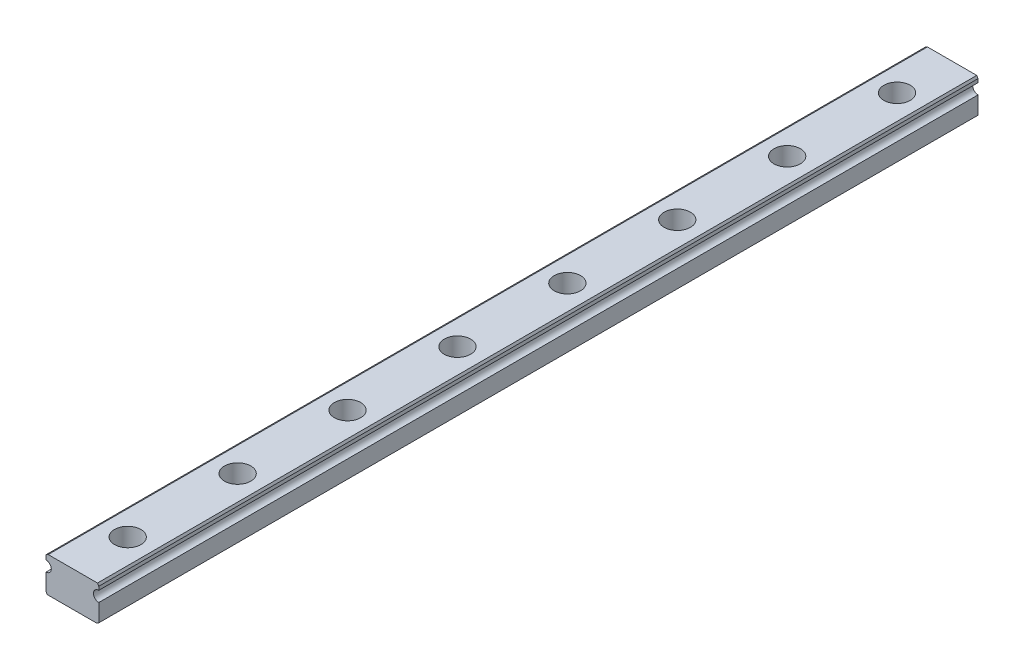
ISO-10303-21;
HEADER;
FILE_DESCRIPTION(('STEP AP214'),'2;1');
FILE_NAME('part.step','',(''),(''),'','','');
FILE_SCHEMA(('AUTOMOTIVE_DESIGN { 1 0 10303 214 1 1 1 1 }'));
ENDSEC;
DATA;
#1=APPLICATION_CONTEXT('core data for automotive mechanical design processes');
#2=APPLICATION_PROTOCOL_DEFINITION('international standard','automotive_design',2000,#1);
#3=PRODUCT_CONTEXT('',#1,'mechanical');
#4=PRODUCT('Part','Part','',(#3));
#5=PRODUCT_RELATED_PRODUCT_CATEGORY('part','',(#4));
#6=PRODUCT_DEFINITION_FORMATION('','',#4);
#7=PRODUCT_DEFINITION_CONTEXT('part definition',#1,'design');
#8=PRODUCT_DEFINITION('design','',#6,#7);
#9=PRODUCT_DEFINITION_SHAPE('','',#8);
#10=(LENGTH_UNIT() NAMED_UNIT(*) SI_UNIT(.MILLI.,.METRE.));
#11=(NAMED_UNIT(*) PLANE_ANGLE_UNIT() SI_UNIT($,.RADIAN.));
#12=(NAMED_UNIT(*) SI_UNIT($,.STERADIAN.) SOLID_ANGLE_UNIT());
#13=UNCERTAINTY_MEASURE_WITH_UNIT(LENGTH_MEASURE(1.E-05),#10,'distance_accuracy_value','');
#14=(GEOMETRIC_REPRESENTATION_CONTEXT(3) GLOBAL_UNCERTAINTY_ASSIGNED_CONTEXT((#13)) GLOBAL_UNIT_ASSIGNED_CONTEXT((#10,
#11,#12)) REPRESENTATION_CONTEXT('',''));
#15=CARTESIAN_POINT('',(0.,0.,0.));
#16=DIRECTION('',(0.,0.,1.));
#17=DIRECTION('',(1.,0.,0.));
#18=AXIS2_PLACEMENT_3D('',#15,#16,#17);
#19=CARTESIAN_POINT('',(0.0924546286147632,-4.001,-87.5));
#20=DIRECTION('',(0.,1.,0.));
#21=DIRECTION('',(0.,0.,1.));
#22=AXIS2_PLACEMENT_3D('',#19,#20,#21);
#23=CYLINDRICAL_SURFACE('',#22,1.75);
#24=CARTESIAN_POINT('',(0.0924546286147632,-4.,-87.5));
#25=DIRECTION('',(0.,1.,0.));
#26=DIRECTION('',(0.,0.,1.));
#27=AXIS2_PLACEMENT_3D('',#24,#25,#26);
#28=CIRCLE('',#27,1.75);
#29=CARTESIAN_POINT('',(0.0924546286147632,-4.,-85.75));
#30=VERTEX_POINT('',#29);
#31=EDGE_CURVE('E257',#30,#30,#28,.F.);
#32=ORIENTED_EDGE('',*,*,#31,.T.);
#33=EDGE_LOOP('',(#32));
#34=FACE_BOUND('',#33,.T.);
#35=CARTESIAN_POINT('',(0.0924546286147632,-0.5,-87.5));
#36=DIRECTION('',(0.,1.,0.));
#37=DIRECTION('',(0.,0.,1.));
#38=AXIS2_PLACEMENT_3D('',#35,#36,#37);
#39=CIRCLE('',#38,1.75);
#40=CARTESIAN_POINT('',(0.0924546286147632,-0.5,-85.75));
#41=VERTEX_POINT('',#40);
#42=EDGE_CURVE('E56',#41,#41,#39,.F.);
#43=ORIENTED_EDGE('',*,*,#42,.F.);
#44=EDGE_LOOP('',(#43));
#45=FACE_BOUND('',#44,.T.);
#46=ADVANCED_FACE('F51',(#34,#45),#23,.F.);
#47=CARTESIAN_POINT('',(0.0924546286147632,-4.001,-62.5));
#48=DIRECTION('',(0.,1.,0.));
#49=DIRECTION('',(0.,0.,1.));
#50=AXIS2_PLACEMENT_3D('',#47,#48,#49);
#51=CYLINDRICAL_SURFACE('',#50,1.75);
#52=CARTESIAN_POINT('',(0.0924546286147632,-4.,-62.5));
#53=DIRECTION('',(0.,1.,0.));
#54=DIRECTION('',(0.,0.,1.));
#55=AXIS2_PLACEMENT_3D('',#52,#53,#54);
#56=CIRCLE('',#55,1.75);
#57=CARTESIAN_POINT('',(0.0924546286147632,-4.,-60.75));
#58=VERTEX_POINT('',#57);
#59=EDGE_CURVE('E261',#58,#58,#56,.F.);
#60=ORIENTED_EDGE('',*,*,#59,.T.);
#61=EDGE_LOOP('',(#60));
#62=FACE_BOUND('',#61,.T.);
#63=CARTESIAN_POINT('',(0.0924546286147632,-0.5,-62.5));
#64=DIRECTION('',(0.,1.,0.));
#65=DIRECTION('',(0.,0.,1.));
#66=AXIS2_PLACEMENT_3D('',#63,#64,#65);
#67=CIRCLE('',#66,1.75);
#68=CARTESIAN_POINT('',(0.0924546286147632,-0.5,-60.75));
#69=VERTEX_POINT('',#68);
#70=EDGE_CURVE('E252',#69,#69,#67,.F.);
#71=ORIENTED_EDGE('',*,*,#70,.F.);
#72=EDGE_LOOP('',(#71));
#73=FACE_BOUND('',#72,.T.);
#74=ADVANCED_FACE('F334',(#62,#73),#51,.F.);
#75=CARTESIAN_POINT('',(0.0924546286147632,-4.001,-37.5));
#76=DIRECTION('',(0.,1.,0.));
#77=DIRECTION('',(0.,0.,1.));
#78=AXIS2_PLACEMENT_3D('',#75,#76,#77);
#79=CYLINDRICAL_SURFACE('',#78,1.75);
#80=CARTESIAN_POINT('',(0.0924546286147632,-4.,-37.5));
#81=DIRECTION('',(0.,1.,0.));
#82=DIRECTION('',(0.,0.,1.));
#83=AXIS2_PLACEMENT_3D('',#80,#81,#82);
#84=CIRCLE('',#83,1.75);
#85=CARTESIAN_POINT('',(0.0924546286147632,-4.,-35.75));
#86=VERTEX_POINT('',#85);
#87=EDGE_CURVE('E266',#86,#86,#84,.F.);
#88=ORIENTED_EDGE('',*,*,#87,.T.);
#89=EDGE_LOOP('',(#88));
#90=FACE_BOUND('',#89,.T.);
#91=CARTESIAN_POINT('',(0.0924546286147632,-0.5,-37.5));
#92=DIRECTION('',(0.,1.,0.));
#93=DIRECTION('',(0.,0.,1.));
#94=AXIS2_PLACEMENT_3D('',#91,#92,#93);
#95=CIRCLE('',#94,1.75);
#96=CARTESIAN_POINT('',(0.0924546286147632,-0.5,-35.75));
#97=VERTEX_POINT('',#96);
#98=EDGE_CURVE('E250',#97,#97,#95,.F.);
#99=ORIENTED_EDGE('',*,*,#98,.F.);
#100=EDGE_LOOP('',(#99));
#101=FACE_BOUND('',#100,.T.);
#102=ADVANCED_FACE('F339',(#90,#101),#79,.F.);
#103=CARTESIAN_POINT('',(0.0924546286147632,-4.001,-12.5));
#104=DIRECTION('',(0.,1.,0.));
#105=DIRECTION('',(0.,0.,1.));
#106=AXIS2_PLACEMENT_3D('',#103,#104,#105);
#107=CYLINDRICAL_SURFACE('',#106,1.75);
#108=CARTESIAN_POINT('',(0.0924546286147632,-4.,-12.5));
#109=DIRECTION('',(0.,1.,0.));
#110=DIRECTION('',(0.,0.,1.));
#111=AXIS2_PLACEMENT_3D('',#108,#109,#110);
#112=CIRCLE('',#111,1.75);
#113=CARTESIAN_POINT('',(0.0924546286147632,-4.,-10.75));
#114=VERTEX_POINT('',#113);
#115=EDGE_CURVE('E734',#114,#114,#112,.F.);
#116=ORIENTED_EDGE('',*,*,#115,.T.);
#117=EDGE_LOOP('',(#116));
#118=FACE_BOUND('',#117,.T.);
#119=CARTESIAN_POINT('',(0.0924546286147632,-0.5,-12.5));
#120=DIRECTION('',(0.,1.,0.));
#121=DIRECTION('',(0.,0.,1.));
#122=AXIS2_PLACEMENT_3D('',#119,#120,#121);
#123=CIRCLE('',#122,1.75);
#124=CARTESIAN_POINT('',(0.0924546286147632,-0.5,-10.75));
#125=VERTEX_POINT('',#124);
#126=EDGE_CURVE('E247',#125,#125,#123,.F.);
#127=ORIENTED_EDGE('',*,*,#126,.F.);
#128=EDGE_LOOP('',(#127));
#129=FACE_BOUND('',#128,.T.);
#130=ADVANCED_FACE('F618',(#118,#129),#107,.F.);
#131=CARTESIAN_POINT('',(0.0924546286147632,-4.001,12.5));
#132=DIRECTION('',(0.,1.,0.));
#133=DIRECTION('',(0.,0.,1.));
#134=AXIS2_PLACEMENT_3D('',#131,#132,#133);
#135=CYLINDRICAL_SURFACE('',#134,1.75);
#136=CARTESIAN_POINT('',(0.0924546286147632,-4.,12.5));
#137=DIRECTION('',(0.,1.,0.));
#138=DIRECTION('',(0.,0.,1.));
#139=AXIS2_PLACEMENT_3D('',#136,#137,#138);
#140=CIRCLE('',#139,1.75);
#141=CARTESIAN_POINT('',(0.0924546286147632,-4.,14.25));
#142=VERTEX_POINT('',#141);
#143=EDGE_CURVE('E726',#142,#142,#140,.F.);
#144=ORIENTED_EDGE('',*,*,#143,.T.);
#145=EDGE_LOOP('',(#144));
#146=FACE_BOUND('',#145,.T.);
#147=CARTESIAN_POINT('',(0.0924546286147632,-0.5,12.5));
#148=DIRECTION('',(0.,1.,0.));
#149=DIRECTION('',(0.,0.,1.));
#150=AXIS2_PLACEMENT_3D('',#147,#148,#149);
#151=CIRCLE('',#150,1.75);
#152=CARTESIAN_POINT('',(0.0924546286147632,-0.5,14.25));
#153=VERTEX_POINT('',#152);
#154=EDGE_CURVE('E244',#153,#153,#151,.F.);
#155=ORIENTED_EDGE('',*,*,#154,.F.);
#156=EDGE_LOOP('',(#155));
#157=FACE_BOUND('',#156,.T.);
#158=ADVANCED_FACE('F627',(#146,#157),#135,.F.);
#159=CARTESIAN_POINT('',(0.0924546286147632,-4.001,37.5));
#160=DIRECTION('',(0.,1.,0.));
#161=DIRECTION('',(0.,0.,1.));
#162=AXIS2_PLACEMENT_3D('',#159,#160,#161);
#163=CYLINDRICAL_SURFACE('',#162,1.75);
#164=CARTESIAN_POINT('',(0.0924546286147632,-4.,37.5));
#165=DIRECTION('',(0.,1.,0.));
#166=DIRECTION('',(0.,0.,1.));
#167=AXIS2_PLACEMENT_3D('',#164,#165,#166);
#168=CIRCLE('',#167,1.75);
#169=CARTESIAN_POINT('',(0.0924546286147632,-4.,39.25));
#170=VERTEX_POINT('',#169);
#171=EDGE_CURVE('E723',#170,#170,#168,.F.);
#172=ORIENTED_EDGE('',*,*,#171,.T.);
#173=EDGE_LOOP('',(#172));
#174=FACE_BOUND('',#173,.T.);
#175=CARTESIAN_POINT('',(0.0924546286147632,-0.5,37.5));
#176=DIRECTION('',(0.,1.,0.));
#177=DIRECTION('',(0.,0.,1.));
#178=AXIS2_PLACEMENT_3D('',#175,#176,#177);
#179=CIRCLE('',#178,1.75);
#180=CARTESIAN_POINT('',(0.0924546286147632,-0.5,39.25));
#181=VERTEX_POINT('',#180);
#182=EDGE_CURVE('E240',#181,#181,#179,.F.);
#183=ORIENTED_EDGE('',*,*,#182,.F.);
#184=EDGE_LOOP('',(#183));
#185=FACE_BOUND('',#184,.T.);
#186=ADVANCED_FACE('F637',(#174,#185),#163,.F.);
#187=CARTESIAN_POINT('',(0.0924546286147632,-4.001,62.5));
#188=DIRECTION('',(0.,1.,0.));
#189=DIRECTION('',(0.,0.,1.));
#190=AXIS2_PLACEMENT_3D('',#187,#188,#189);
#191=CYLINDRICAL_SURFACE('',#190,1.75);
#192=CARTESIAN_POINT('',(0.0924546286147632,-4.,62.5));
#193=DIRECTION('',(0.,1.,0.));
#194=DIRECTION('',(0.,0.,1.));
#195=AXIS2_PLACEMENT_3D('',#192,#193,#194);
#196=CIRCLE('',#195,1.75);
#197=CARTESIAN_POINT('',(0.0924546286147632,-4.,64.25));
#198=VERTEX_POINT('',#197);
#199=EDGE_CURVE('E275',#198,#198,#196,.F.);
#200=ORIENTED_EDGE('',*,*,#199,.T.);
#201=EDGE_LOOP('',(#200));
#202=FACE_BOUND('',#201,.T.);
#203=CARTESIAN_POINT('',(0.0924546286147632,-0.5,62.5));
#204=DIRECTION('',(0.,1.,0.));
#205=DIRECTION('',(0.,0.,1.));
#206=AXIS2_PLACEMENT_3D('',#203,#204,#205);
#207=CIRCLE('',#206,1.75);
#208=CARTESIAN_POINT('',(0.0924546286147632,-0.5,64.25));
#209=VERTEX_POINT('',#208);
#210=EDGE_CURVE('E237',#209,#209,#207,.F.);
#211=ORIENTED_EDGE('',*,*,#210,.F.);
#212=EDGE_LOOP('',(#211));
#213=FACE_BOUND('',#212,.T.);
#214=ADVANCED_FACE('F356',(#202,#213),#191,.F.);
#215=CARTESIAN_POINT('',(0.0924546286147632,-4.001,87.5));
#216=DIRECTION('',(0.,1.,0.));
#217=DIRECTION('',(0.,0.,1.));
#218=AXIS2_PLACEMENT_3D('',#215,#216,#217);
#219=CYLINDRICAL_SURFACE('',#218,1.75);
#220=CARTESIAN_POINT('',(0.0924546286147632,-4.,87.5));
#221=DIRECTION('',(0.,1.,0.));
#222=DIRECTION('',(0.,0.,1.));
#223=AXIS2_PLACEMENT_3D('',#220,#221,#222);
#224=CIRCLE('',#223,1.75);
#225=CARTESIAN_POINT('',(0.0924546286147632,-4.,89.25));
#226=VERTEX_POINT('',#225);
#227=EDGE_CURVE('E181',#226,#226,#224,.F.);
#228=ORIENTED_EDGE('',*,*,#227,.T.);
#229=EDGE_LOOP('',(#228));
#230=FACE_BOUND('',#229,.T.);
#231=CARTESIAN_POINT('',(0.0924546286147632,-0.5,87.5));
#232=DIRECTION('',(0.,1.,0.));
#233=DIRECTION('',(0.,0.,1.));
#234=AXIS2_PLACEMENT_3D('',#231,#232,#233);
#235=CIRCLE('',#234,1.75);
#236=CARTESIAN_POINT('',(0.0924546286147632,-0.5,89.25));
#237=VERTEX_POINT('',#236);
#238=EDGE_CURVE('E233',#237,#237,#235,.F.);
#239=ORIENTED_EDGE('',*,*,#238,.F.);
#240=EDGE_LOOP('',(#239));
#241=FACE_BOUND('',#240,.T.);
#242=ADVANCED_FACE('F329',(#230,#241),#219,.F.);
#243=CARTESIAN_POINT('',(6.,2.7,100.));
#244=DIRECTION('',(-1.,0.,0.));
#245=DIRECTION('',(0.,0.,1.));
#246=AXIS2_PLACEMENT_3D('',#243,#244,#245);
#247=PLANE('',#246);
#248=DIRECTION('',(0.,1.,0.));
#249=VECTOR('',#248,1.);
#250=CARTESIAN_POINT('',(6.,2.7,-100.));
#251=LINE('',#250,#249);
#252=CARTESIAN_POINT('',(6.,2.7,-100.));
#253=VERTEX_POINT('',#252);
#254=CARTESIAN_POINT('',(6.,3.5,-100.));
#255=VERTEX_POINT('',#254);
#256=EDGE_CURVE('E177',#253,#255,#251,.T.);
#257=ORIENTED_EDGE('',*,*,#256,.T.);
#258=DIRECTION('',(0.,0.,1.));
#259=VECTOR('',#258,1.);
#260=CARTESIAN_POINT('',(6.,3.5,100.));
#261=LINE('',#260,#259);
#262=CARTESIAN_POINT('',(6.,3.5,100.));
#263=VERTEX_POINT('',#262);
#264=EDGE_CURVE('E61',#255,#263,#261,.T.);
#265=ORIENTED_EDGE('',*,*,#264,.T.);
#266=DIRECTION('',(0.,1.,0.));
#267=VECTOR('',#266,1.);
#268=CARTESIAN_POINT('',(6.,2.7,100.));
#269=LINE('',#268,#267);
#270=CARTESIAN_POINT('',(6.,2.7,100.));
#271=VERTEX_POINT('',#270);
#272=EDGE_CURVE('E197',#271,#263,#269,.T.);
#273=ORIENTED_EDGE('',*,*,#272,.F.);
#274=DIRECTION('',(0.,0.,-1.));
#275=VECTOR('',#274,1.);
#276=CARTESIAN_POINT('',(6.,2.7,100.));
#277=LINE('',#276,#275);
#278=EDGE_CURVE('E176',#271,#253,#277,.T.);
#279=ORIENTED_EDGE('',*,*,#278,.T.);
#280=EDGE_LOOP('',(#257,#265,#273,#279));
#281=FACE_BOUND('',#280,.T.);
#282=ADVANCED_FACE('F316',(#281),#247,.F.);
#283=CARTESIAN_POINT('',(-6.,4.,100.));
#284=DIRECTION('',(0.,-1.,0.));
#285=DIRECTION('',(0.,0.,-1.));
#286=AXIS2_PLACEMENT_3D('',#283,#284,#285);
#287=PLANE('',#286);
#288=CARTESIAN_POINT('',(0.0924546286147632,4.,62.5));
#289=DIRECTION('',(0.,1.,0.));
#290=DIRECTION('',(0.,0.,1.));
#291=AXIS2_PLACEMENT_3D('',#288,#289,#290);
#292=CIRCLE('',#291,3.);
#293=CARTESIAN_POINT('',(0.0924546286147632,4.,65.5));
#294=VERTEX_POINT('',#293);
#295=EDGE_CURVE('E795',#294,#294,#292,.T.);
#296=ORIENTED_EDGE('',*,*,#295,.F.);
#297=EDGE_LOOP('',(#296));
#298=FACE_BOUND('',#297,.T.);
#299=CARTESIAN_POINT('',(0.0924546286147632,4.,37.5));
#300=DIRECTION('',(0.,1.,0.));
#301=DIRECTION('',(0.,0.,1.));
#302=AXIS2_PLACEMENT_3D('',#299,#300,#301);
#303=CIRCLE('',#302,3.);
#304=CARTESIAN_POINT('',(0.0924546286147632,4.,40.5));
#305=VERTEX_POINT('',#304);
#306=EDGE_CURVE('E789',#305,#305,#303,.T.);
#307=ORIENTED_EDGE('',*,*,#306,.F.);
#308=EDGE_LOOP('',(#307));
#309=FACE_BOUND('',#308,.T.);
#310=CARTESIAN_POINT('',(0.0924546286147632,4.,12.5));
#311=DIRECTION('',(0.,1.,0.));
#312=DIRECTION('',(0.,0.,1.));
#313=AXIS2_PLACEMENT_3D('',#310,#311,#312);
#314=CIRCLE('',#313,3.);
#315=CARTESIAN_POINT('',(0.0924546286147632,4.,15.5));
#316=VERTEX_POINT('',#315);
#317=EDGE_CURVE('E783',#316,#316,#314,.T.);
#318=ORIENTED_EDGE('',*,*,#317,.F.);
#319=EDGE_LOOP('',(#318));
#320=FACE_BOUND('',#319,.T.);
#321=CARTESIAN_POINT('',(0.0924546286147632,4.,-12.5));
#322=DIRECTION('',(0.,1.,0.));
#323=DIRECTION('',(0.,0.,1.));
#324=AXIS2_PLACEMENT_3D('',#321,#322,#323);
#325=CIRCLE('',#324,3.);
#326=CARTESIAN_POINT('',(0.0924546286147632,4.,-9.49999999999999));
#327=VERTEX_POINT('',#326);
#328=EDGE_CURVE('E777',#327,#327,#325,.T.);
#329=ORIENTED_EDGE('',*,*,#328,.F.);
#330=EDGE_LOOP('',(#329));
#331=FACE_BOUND('',#330,.T.);
#332=CARTESIAN_POINT('',(0.0924546286147632,4.,-37.5));
#333=DIRECTION('',(0.,1.,0.));
#334=DIRECTION('',(0.,0.,1.));
#335=AXIS2_PLACEMENT_3D('',#332,#333,#334);
#336=CIRCLE('',#335,3.);
#337=CARTESIAN_POINT('',(0.0924546286147632,4.,-34.5));
#338=VERTEX_POINT('',#337);
#339=EDGE_CURVE('E771',#338,#338,#336,.T.);
#340=ORIENTED_EDGE('',*,*,#339,.F.);
#341=EDGE_LOOP('',(#340));
#342=FACE_BOUND('',#341,.T.);
#343=CARTESIAN_POINT('',(0.0924546286147632,4.,-62.5));
#344=DIRECTION('',(0.,1.,0.));
#345=DIRECTION('',(0.,0.,1.));
#346=AXIS2_PLACEMENT_3D('',#343,#344,#345);
#347=CIRCLE('',#346,3.);
#348=CARTESIAN_POINT('',(0.0924546286147632,4.,-59.5));
#349=VERTEX_POINT('',#348);
#350=EDGE_CURVE('E765',#349,#349,#347,.T.);
#351=ORIENTED_EDGE('',*,*,#350,.F.);
#352=EDGE_LOOP('',(#351));
#353=FACE_BOUND('',#352,.T.);
#354=CARTESIAN_POINT('',(0.0924546286147632,4.,-87.5));
#355=DIRECTION('',(0.,1.,0.));
#356=DIRECTION('',(0.,0.,1.));
#357=AXIS2_PLACEMENT_3D('',#354,#355,#356);
#358=CIRCLE('',#357,3.);
#359=CARTESIAN_POINT('',(0.0924546286147632,4.,-84.5));
#360=VERTEX_POINT('',#359);
#361=EDGE_CURVE('E729',#360,#360,#358,.T.);
#362=ORIENTED_EDGE('',*,*,#361,.F.);
#363=EDGE_LOOP('',(#362));
#364=FACE_BOUND('',#363,.T.);
#365=CARTESIAN_POINT('',(0.0924546286147632,4.,87.5));
#366=DIRECTION('',(0.,1.,0.));
#367=DIRECTION('',(0.,0.,1.));
#368=AXIS2_PLACEMENT_3D('',#365,#366,#367);
#369=CIRCLE('',#368,3.);
#370=CARTESIAN_POINT('',(0.0924546286147632,4.,90.5));
#371=VERTEX_POINT('',#370);
#372=EDGE_CURVE('E272',#371,#371,#369,.T.);
#373=ORIENTED_EDGE('',*,*,#372,.F.);
#374=EDGE_LOOP('',(#373));
#375=FACE_BOUND('',#374,.T.);
#376=DIRECTION('',(-1.,0.,0.));
#377=VECTOR('',#376,1.);
#378=CARTESIAN_POINT('',(-6.,4.,100.));
#379=LINE('',#378,#377);
#380=CARTESIAN_POINT('',(5.71132486540518,4.,100.));
#381=VERTEX_POINT('',#380);
#382=CARTESIAN_POINT('',(-5.5,4.,100.));
#383=VERTEX_POINT('',#382);
#384=EDGE_CURVE('E150',#381,#383,#379,.T.);
#385=ORIENTED_EDGE('',*,*,#384,.F.);
#386=DIRECTION('',(0.,0.,-1.));
#387=VECTOR('',#386,1.);
#388=CARTESIAN_POINT('',(5.71132486540518,4.,100.));
#389=LINE('',#388,#387);
#390=CARTESIAN_POINT('',(5.71132486540518,4.,-100.));
#391=VERTEX_POINT('',#390);
#392=EDGE_CURVE('E229',#381,#391,#389,.T.);
#393=ORIENTED_EDGE('',*,*,#392,.T.);
#394=DIRECTION('',(-1.,0.,0.));
#395=VECTOR('',#394,1.);
#396=CARTESIAN_POINT('',(-6.,4.,-100.));
#397=LINE('',#396,#395);
#398=CARTESIAN_POINT('',(-5.5,4.,-100.));
#399=VERTEX_POINT('',#398);
#400=EDGE_CURVE('E180',#391,#399,#397,.T.);
#401=ORIENTED_EDGE('',*,*,#400,.T.);
#402=DIRECTION('',(0.,0.,1.));
#403=VECTOR('',#402,1.);
#404=CARTESIAN_POINT('',(-5.5,4.,100.));
#405=LINE('',#404,#403);
#406=EDGE_CURVE('E227',#399,#383,#405,.T.);
#407=ORIENTED_EDGE('',*,*,#406,.T.);
#408=EDGE_LOOP('',(#385,#393,#401,#407));
#409=FACE_BOUND('',#408,.T.);
#410=ADVANCED_FACE('F320',(#298,#309,#320,#331,#342,#353,#364,#375,#409),#287,.F.);
#411=CARTESIAN_POINT('',(-6.,2.7,100.));
#412=DIRECTION('',(1.,0.,0.));
#413=DIRECTION('',(0.,0.,-1.));
#414=AXIS2_PLACEMENT_3D('',#411,#412,#413);
#415=PLANE('',#414);
#416=DIRECTION('',(0.,-1.,0.));
#417=VECTOR('',#416,1.);
#418=CARTESIAN_POINT('',(-6.,2.7,100.));
#419=LINE('',#418,#417);
#420=CARTESIAN_POINT('',(-6.,3.71132486540519,100.));
#421=VERTEX_POINT('',#420);
#422=CARTESIAN_POINT('',(-6.,2.7,100.));
#423=VERTEX_POINT('',#422);
#424=EDGE_CURVE('E141',#421,#423,#419,.T.);
#425=ORIENTED_EDGE('',*,*,#424,.F.);
#426=DIRECTION('',(0.,0.,-1.));
#427=VECTOR('',#426,1.);
#428=CARTESIAN_POINT('',(-6.,3.71132486540519,100.));
#429=LINE('',#428,#427);
#430=CARTESIAN_POINT('',(-6.,3.71132486540519,-100.));
#431=VERTEX_POINT('',#430);
#432=EDGE_CURVE('E13',#421,#431,#429,.T.);
#433=ORIENTED_EDGE('',*,*,#432,.T.);
#434=DIRECTION('',(0.,-1.,0.));
#435=VECTOR('',#434,1.);
#436=CARTESIAN_POINT('',(-6.,2.7,-100.));
#437=LINE('',#436,#435);
#438=CARTESIAN_POINT('',(-6.,2.7,-100.));
#439=VERTEX_POINT('',#438);
#440=EDGE_CURVE('E156',#431,#439,#437,.T.);
#441=ORIENTED_EDGE('',*,*,#440,.T.);
#442=DIRECTION('',(0.,0.,-1.));
#443=VECTOR('',#442,1.);
#444=CARTESIAN_POINT('',(-6.,2.7,100.));
#445=LINE('',#444,#443);
#446=EDGE_CURVE('E153',#423,#439,#445,.T.);
#447=ORIENTED_EDGE('',*,*,#446,.F.);
#448=EDGE_LOOP('',(#425,#433,#441,#447));
#449=FACE_BOUND('',#448,.T.);
#450=ADVANCED_FACE('F154',(#449),#415,.F.);
#451=CARTESIAN_POINT('',(-6.,1.5,100.));
#452=DIRECTION('',(0.,0.,-1.));
#453=DIRECTION('',(-1.,0.,0.));
#454=AXIS2_PLACEMENT_3D('',#451,#452,#453);
#455=CYLINDRICAL_SURFACE('',#454,1.2);
#456=CARTESIAN_POINT('',(-6.,1.5,-100.));
#457=DIRECTION('',(0.,0.,-1.));
#458=DIRECTION('',(1.,0.,0.));
#459=AXIS2_PLACEMENT_3D('',#456,#457,#458);
#460=CIRCLE('',#459,1.2);
#461=CARTESIAN_POINT('',(-6.,0.3,-100.));
#462=VERTEX_POINT('',#461);
#463=EDGE_CURVE('E185',#439,#462,#460,.T.);
#464=ORIENTED_EDGE('',*,*,#463,.T.);
#465=DIRECTION('',(0.,0.,-1.));
#466=VECTOR('',#465,1.);
#467=CARTESIAN_POINT('',(-6.,0.3,100.));
#468=LINE('',#467,#466);
#469=CARTESIAN_POINT('',(-6.,0.3,100.));
#470=VERTEX_POINT('',#469);
#471=EDGE_CURVE('E160',#470,#462,#468,.T.);
#472=ORIENTED_EDGE('',*,*,#471,.F.);
#473=CARTESIAN_POINT('',(-6.,1.5,100.));
#474=DIRECTION('',(0.,0.,-1.));
#475=DIRECTION('',(1.,0.,0.));
#476=AXIS2_PLACEMENT_3D('',#473,#474,#475);
#477=CIRCLE('',#476,1.2);
#478=EDGE_CURVE('E146',#423,#470,#477,.T.);
#479=ORIENTED_EDGE('',*,*,#478,.F.);
#480=ORIENTED_EDGE('',*,*,#446,.T.);
#481=EDGE_LOOP('',(#464,#472,#479,#480));
#482=FACE_BOUND('',#481,.T.);
#483=ADVANCED_FACE('F162',(#482),#455,.F.);
#484=CARTESIAN_POINT('',(-6.,-4.,100.));
#485=DIRECTION('',(1.,0.,0.));
#486=DIRECTION('',(0.,0.,-1.));
#487=AXIS2_PLACEMENT_3D('',#484,#485,#486);
#488=PLANE('',#487);
#489=DIRECTION('',(0.,-1.,0.));
#490=VECTOR('',#489,1.);
#491=CARTESIAN_POINT('',(-6.,-4.,-100.));
#492=LINE('',#491,#490);
#493=CARTESIAN_POINT('',(-6.,-3.5,-100.));
#494=VERTEX_POINT('',#493);
#495=EDGE_CURVE('E187',#462,#494,#492,.T.);
#496=ORIENTED_EDGE('',*,*,#495,.T.);
#497=DIRECTION('',(0.,0.,1.));
#498=VECTOR('',#497,1.);
#499=CARTESIAN_POINT('',(-6.,-3.5,100.));
#500=LINE('',#499,#498);
#501=CARTESIAN_POINT('',(-6.,-3.5,100.));
#502=VERTEX_POINT('',#501);
#503=EDGE_CURVE('E216',#494,#502,#500,.T.);
#504=ORIENTED_EDGE('',*,*,#503,.T.);
#505=DIRECTION('',(0.,-1.,0.));
#506=VECTOR('',#505,1.);
#507=CARTESIAN_POINT('',(-6.,-4.,100.));
#508=LINE('',#507,#506);
#509=EDGE_CURVE('E165',#470,#502,#508,.T.);
#510=ORIENTED_EDGE('',*,*,#509,.F.);
#511=ORIENTED_EDGE('',*,*,#471,.T.);
#512=EDGE_LOOP('',(#496,#504,#510,#511));
#513=FACE_BOUND('',#512,.T.);
#514=ADVANCED_FACE('F291',(#513),#488,.F.);
#515=CARTESIAN_POINT('',(-6.,-4.,100.));
#516=DIRECTION('',(0.,1.,0.));
#517=DIRECTION('',(0.,0.,1.));
#518=AXIS2_PLACEMENT_3D('',#515,#516,#517);
#519=PLANE('',#518);
#520=ORIENTED_EDGE('',*,*,#199,.F.);
#521=EDGE_LOOP('',(#520));
#522=FACE_BOUND('',#521,.T.);
#523=ORIENTED_EDGE('',*,*,#171,.F.);
#524=EDGE_LOOP('',(#523));
#525=FACE_BOUND('',#524,.T.);
#526=ORIENTED_EDGE('',*,*,#143,.F.);
#527=EDGE_LOOP('',(#526));
#528=FACE_BOUND('',#527,.T.);
#529=ORIENTED_EDGE('',*,*,#115,.F.);
#530=EDGE_LOOP('',(#529));
#531=FACE_BOUND('',#530,.T.);
#532=ORIENTED_EDGE('',*,*,#87,.F.);
#533=EDGE_LOOP('',(#532));
#534=FACE_BOUND('',#533,.T.);
#535=ORIENTED_EDGE('',*,*,#59,.F.);
#536=EDGE_LOOP('',(#535));
#537=FACE_BOUND('',#536,.T.);
#538=ORIENTED_EDGE('',*,*,#31,.F.);
#539=EDGE_LOOP('',(#538));
#540=FACE_BOUND('',#539,.T.);
#541=ORIENTED_EDGE('',*,*,#227,.F.);
#542=EDGE_LOOP('',(#541));
#543=FACE_BOUND('',#542,.T.);
#544=DIRECTION('',(1.,0.,0.));
#545=VECTOR('',#544,1.);
#546=CARTESIAN_POINT('',(-6.,-4.,100.));
#547=LINE('',#546,#545);
#548=CARTESIAN_POINT('',(-5.71132486540519,-4.,100.));
#549=VERTEX_POINT('',#548);
#550=CARTESIAN_POINT('',(5.5,-4.,100.));
#551=VERTEX_POINT('',#550);
#552=EDGE_CURVE('E167',#549,#551,#547,.T.);
#553=ORIENTED_EDGE('',*,*,#552,.F.);
#554=DIRECTION('',(0.,0.,-1.));
#555=VECTOR('',#554,1.);
#556=CARTESIAN_POINT('',(-5.71132486540519,-4.,100.));
#557=LINE('',#556,#555);
#558=CARTESIAN_POINT('',(-5.71132486540519,-4.,-100.));
#559=VERTEX_POINT('',#558);
#560=EDGE_CURVE('E205',#549,#559,#557,.T.);
#561=ORIENTED_EDGE('',*,*,#560,.T.);
#562=DIRECTION('',(1.,0.,0.));
#563=VECTOR('',#562,1.);
#564=CARTESIAN_POINT('',(-6.,-4.,-100.));
#565=LINE('',#564,#563);
#566=CARTESIAN_POINT('',(5.5,-4.,-100.));
#567=VERTEX_POINT('',#566);
#568=EDGE_CURVE('E190',#559,#567,#565,.T.);
#569=ORIENTED_EDGE('',*,*,#568,.T.);
#570=DIRECTION('',(0.,0.,1.));
#571=VECTOR('',#570,1.);
#572=CARTESIAN_POINT('',(5.5,-4.,100.));
#573=LINE('',#572,#571);
#574=EDGE_CURVE('E159',#567,#551,#573,.T.);
#575=ORIENTED_EDGE('',*,*,#574,.T.);
#576=EDGE_LOOP('',(#553,#561,#569,#575));
#577=FACE_BOUND('',#576,.T.);
#578=ADVANCED_FACE('F299',(#522,#525,#528,#531,#534,#537,#540,#543,#577),#519,.F.);
#579=CARTESIAN_POINT('',(6.,-4.,100.));
#580=DIRECTION('',(-1.,0.,0.));
#581=DIRECTION('',(0.,0.,1.));
#582=AXIS2_PLACEMENT_3D('',#579,#580,#581);
#583=PLANE('',#582);
#584=DIRECTION('',(0.,1.,0.));
#585=VECTOR('',#584,1.);
#586=CARTESIAN_POINT('',(6.,-4.,100.));
#587=LINE('',#586,#585);
#588=CARTESIAN_POINT('',(6.,-3.71132486540519,100.));
#589=VERTEX_POINT('',#588);
#590=CARTESIAN_POINT('',(6.,0.3,100.));
#591=VERTEX_POINT('',#590);
#592=EDGE_CURVE('E172',#589,#591,#587,.T.);
#593=ORIENTED_EDGE('',*,*,#592,.F.);
#594=DIRECTION('',(0.,0.,-1.));
#595=VECTOR('',#594,1.);
#596=CARTESIAN_POINT('',(6.,-3.71132486540519,100.));
#597=LINE('',#596,#595);
#598=CARTESIAN_POINT('',(6.,-3.71132486540519,-100.));
#599=VERTEX_POINT('',#598);
#600=EDGE_CURVE('E224',#589,#599,#597,.T.);
#601=ORIENTED_EDGE('',*,*,#600,.T.);
#602=DIRECTION('',(0.,1.,0.));
#603=VECTOR('',#602,1.);
#604=CARTESIAN_POINT('',(6.,-4.,-100.));
#605=LINE('',#604,#603);
#606=CARTESIAN_POINT('',(6.,0.3,-100.));
#607=VERTEX_POINT('',#606);
#608=EDGE_CURVE('E193',#599,#607,#605,.T.);
#609=ORIENTED_EDGE('',*,*,#608,.T.);
#610=DIRECTION('',(0.,0.,-1.));
#611=VECTOR('',#610,1.);
#612=CARTESIAN_POINT('',(6.,0.3,100.));
#613=LINE('',#612,#611);
#614=EDGE_CURVE('E200',#591,#607,#613,.T.);
#615=ORIENTED_EDGE('',*,*,#614,.F.);
#616=EDGE_LOOP('',(#593,#601,#609,#615));
#617=FACE_BOUND('',#616,.T.);
#618=ADVANCED_FACE('F307',(#617),#583,.F.);
#619=CARTESIAN_POINT('',(6.,1.5,100.));
#620=DIRECTION('',(0.,0.,-1.));
#621=DIRECTION('',(-1.,0.,0.));
#622=AXIS2_PLACEMENT_3D('',#619,#620,#621);
#623=CYLINDRICAL_SURFACE('',#622,1.2);
#624=CARTESIAN_POINT('',(6.,1.5,-100.));
#625=DIRECTION('',(0.,0.,-1.));
#626=DIRECTION('',(-1.,0.,0.));
#627=AXIS2_PLACEMENT_3D('',#624,#625,#626);
#628=CIRCLE('',#627,1.2);
#629=EDGE_CURVE('E195',#607,#253,#628,.T.);
#630=ORIENTED_EDGE('',*,*,#629,.T.);
#631=ORIENTED_EDGE('',*,*,#278,.F.);
#632=CARTESIAN_POINT('',(6.,1.5,100.));
#633=DIRECTION('',(0.,0.,-1.));
#634=DIRECTION('',(-1.,0.,0.));
#635=AXIS2_PLACEMENT_3D('',#632,#633,#634);
#636=CIRCLE('',#635,1.2);
#637=EDGE_CURVE('E174',#591,#271,#636,.T.);
#638=ORIENTED_EDGE('',*,*,#637,.F.);
#639=ORIENTED_EDGE('',*,*,#614,.T.);
#640=EDGE_LOOP('',(#630,#631,#638,#639));
#641=FACE_BOUND('',#640,.T.);
#642=ADVANCED_FACE('F313',(#641),#623,.F.);
#643=CARTESIAN_POINT('',(-6.,1.5,100.));
#644=DIRECTION('',(0.,0.,1.));
#645=DIRECTION('',(1.,0.,0.));
#646=AXIS2_PLACEMENT_3D('',#643,#644,#645);
#647=PLANE('',#646);
#648=ORIENTED_EDGE('',*,*,#509,.T.);
#649=DIRECTION('',(-0.499999999999996,0.866025403784441,0.));
#650=VECTOR('',#649,1.);
#651=CARTESIAN_POINT('',(-8.16506350946108,0.250000000000022,100.));
#652=LINE('',#651,#650);
#653=EDGE_CURVE('E222',#502,#549,#652,.F.);
#654=ORIENTED_EDGE('',*,*,#653,.T.);
#655=ORIENTED_EDGE('',*,*,#552,.T.);
#656=DIRECTION('',(-0.866025403784441,-0.499999999999996,0.));
#657=VECTOR('',#656,1.);
#658=CARTESIAN_POINT('',(-0.743430139592861,-7.60464607176052,100.));
#659=LINE('',#658,#657);
#660=EDGE_CURVE('E69',#551,#589,#659,.F.);
#661=ORIENTED_EDGE('',*,*,#660,.T.);
#662=ORIENTED_EDGE('',*,*,#592,.T.);
#663=ORIENTED_EDGE('',*,*,#637,.T.);
#664=ORIENTED_EDGE('',*,*,#272,.T.);
#665=DIRECTION('',(0.500000000000014,-0.866025403784431,0.));
#666=VECTOR('',#665,1.);
#667=CARTESIAN_POINT('',(3.86602540378429,7.19615242270675,100.));
#668=LINE('',#667,#666);
#669=EDGE_CURVE('E219',#263,#381,#668,.F.);
#670=ORIENTED_EDGE('',*,*,#669,.T.);
#671=ORIENTED_EDGE('',*,*,#384,.T.);
#672=DIRECTION('',(0.866025403784441,0.499999999999996,0.));
#673=VECTOR('',#672,1.);
#674=CARTESIAN_POINT('',(-6.95753175473055,3.1584936490539,100.));
#675=LINE('',#674,#673);
#676=EDGE_CURVE('E76',#383,#421,#675,.F.);
#677=ORIENTED_EDGE('',*,*,#676,.T.);
#678=ORIENTED_EDGE('',*,*,#424,.T.);
#679=ORIENTED_EDGE('',*,*,#478,.T.);
#680=EDGE_LOOP('',(#648,#654,#655,#661,#662,#663,#664,#670,#671,#677,#678,#679));
#681=FACE_BOUND('',#680,.T.);
#682=ADVANCED_FACE('F144',(#681),#647,.T.);
#683=CARTESIAN_POINT('',(-6.,1.5,-100.));
#684=DIRECTION('',(0.,0.,1.));
#685=DIRECTION('',(1.,0.,0.));
#686=AXIS2_PLACEMENT_3D('',#683,#684,#685);
#687=PLANE('',#686);
#688=ORIENTED_EDGE('',*,*,#568,.F.);
#689=DIRECTION('',(0.499999999999996,-0.866025403784441,0.));
#690=VECTOR('',#689,1.);
#691=CARTESIAN_POINT('',(-5.71132486540519,-4.,-100.));
#692=LINE('',#691,#690);
#693=EDGE_CURVE('E214',#559,#494,#692,.F.);
#694=ORIENTED_EDGE('',*,*,#693,.T.);
#695=ORIENTED_EDGE('',*,*,#495,.F.);
#696=ORIENTED_EDGE('',*,*,#463,.F.);
#697=ORIENTED_EDGE('',*,*,#440,.F.);
#698=DIRECTION('',(-0.866025403784441,-0.499999999999996,0.));
#699=VECTOR('',#698,1.);
#700=CARTESIAN_POINT('',(-6.,3.71132486540519,-100.));
#701=LINE('',#700,#699);
#702=EDGE_CURVE('E208',#431,#399,#701,.F.);
#703=ORIENTED_EDGE('',*,*,#702,.T.);
#704=ORIENTED_EDGE('',*,*,#400,.F.);
#705=DIRECTION('',(-0.500000000000014,0.866025403784431,0.));
#706=VECTOR('',#705,1.);
#707=CARTESIAN_POINT('',(5.71132486540518,4.,-100.));
#708=LINE('',#707,#706);
#709=EDGE_CURVE('E210',#391,#255,#708,.F.);
#710=ORIENTED_EDGE('',*,*,#709,.T.);
#711=ORIENTED_EDGE('',*,*,#256,.F.);
#712=ORIENTED_EDGE('',*,*,#629,.F.);
#713=ORIENTED_EDGE('',*,*,#608,.F.);
#714=DIRECTION('',(0.866025403784441,0.499999999999996,0.));
#715=VECTOR('',#714,1.);
#716=CARTESIAN_POINT('',(6.,-3.71132486540519,-100.));
#717=LINE('',#716,#715);
#718=EDGE_CURVE('E212',#599,#567,#717,.F.);
#719=ORIENTED_EDGE('',*,*,#718,.T.);
#720=EDGE_LOOP('',(#688,#694,#695,#696,#697,#703,#704,#710,#711,#712,#713,#719));
#721=FACE_BOUND('',#720,.T.);
#722=ADVANCED_FACE('F287',(#721),#687,.F.);
#723=CARTESIAN_POINT('',(-5.71132486540519,-4.,100.));
#724=DIRECTION('',(0.866025403784441,0.499999999999996,0.));
#725=DIRECTION('',(0.,0.,-1.));
#726=AXIS2_PLACEMENT_3D('',#723,#724,#725);
#727=PLANE('',#726);
#728=ORIENTED_EDGE('',*,*,#653,.F.);
#729=ORIENTED_EDGE('',*,*,#503,.F.);
#730=ORIENTED_EDGE('',*,*,#693,.F.);
#731=ORIENTED_EDGE('',*,*,#560,.F.);
#732=EDGE_LOOP('',(#728,#729,#730,#731));
#733=FACE_BOUND('',#732,.T.);
#734=ADVANCED_FACE('F297',(#733),#727,.F.);
#735=CARTESIAN_POINT('',(6.,-3.71132486540519,100.));
#736=DIRECTION('',(-0.499999999999996,0.866025403784441,0.));
#737=DIRECTION('',(0.,0.,-1.));
#738=AXIS2_PLACEMENT_3D('',#735,#736,#737);
#739=PLANE('',#738);
#740=ORIENTED_EDGE('',*,*,#660,.F.);
#741=ORIENTED_EDGE('',*,*,#574,.F.);
#742=ORIENTED_EDGE('',*,*,#718,.F.);
#743=ORIENTED_EDGE('',*,*,#600,.F.);
#744=EDGE_LOOP('',(#740,#741,#742,#743));
#745=FACE_BOUND('',#744,.T.);
#746=ADVANCED_FACE('F305',(#745),#739,.F.);
#747=CARTESIAN_POINT('',(5.71132486540518,4.,100.));
#748=DIRECTION('',(-0.866025403784431,-0.500000000000014,0.));
#749=DIRECTION('',(0.,0.,-1.));
#750=AXIS2_PLACEMENT_3D('',#747,#748,#749);
#751=PLANE('',#750);
#752=ORIENTED_EDGE('',*,*,#669,.F.);
#753=ORIENTED_EDGE('',*,*,#264,.F.);
#754=ORIENTED_EDGE('',*,*,#709,.F.);
#755=ORIENTED_EDGE('',*,*,#392,.F.);
#756=EDGE_LOOP('',(#752,#753,#754,#755));
#757=FACE_BOUND('',#756,.T.);
#758=ADVANCED_FACE('F319',(#757),#751,.F.);
#759=CARTESIAN_POINT('',(-6.,3.71132486540519,100.));
#760=DIRECTION('',(0.499999999999996,-0.866025403784441,0.));
#761=DIRECTION('',(0.,0.,-1.));
#762=AXIS2_PLACEMENT_3D('',#759,#760,#761);
#763=PLANE('',#762);
#764=ORIENTED_EDGE('',*,*,#676,.F.);
#765=ORIENTED_EDGE('',*,*,#406,.F.);
#766=ORIENTED_EDGE('',*,*,#702,.F.);
#767=ORIENTED_EDGE('',*,*,#432,.F.);
#768=EDGE_LOOP('',(#764,#765,#766,#767));
#769=FACE_BOUND('',#768,.T.);
#770=ADVANCED_FACE('F54',(#769),#763,.F.);
#771=CARTESIAN_POINT('',(0.0924546286147632,-0.5,87.5));
#772=DIRECTION('',(0.,1.,0.));
#773=DIRECTION('',(0.,0.,1.));
#774=AXIS2_PLACEMENT_3D('',#771,#772,#773);
#775=PLANE('',#774);
#776=CARTESIAN_POINT('',(0.0924546286147632,-0.5,87.5));
#777=DIRECTION('',(0.,1.,0.));
#778=DIRECTION('',(0.,0.,1.));
#779=AXIS2_PLACEMENT_3D('',#776,#777,#778);
#780=CIRCLE('',#779,3.);
#781=CARTESIAN_POINT('',(0.0924546286147632,-0.5,90.5));
#782=VERTEX_POINT('',#781);
#783=EDGE_CURVE('E236',#782,#782,#780,.T.);
#784=ORIENTED_EDGE('',*,*,#783,.T.);
#785=EDGE_LOOP('',(#784));
#786=FACE_BOUND('',#785,.T.);
#787=ORIENTED_EDGE('',*,*,#238,.T.);
#788=EDGE_LOOP('',(#787));
#789=FACE_BOUND('',#788,.T.);
#790=ADVANCED_FACE('F345',(#786,#789),#775,.T.);
#791=CARTESIAN_POINT('',(0.0924546286147632,-0.5,87.5));
#792=DIRECTION('',(0.,1.,0.));
#793=DIRECTION('',(0.,0.,1.));
#794=AXIS2_PLACEMENT_3D('',#791,#792,#793);
#795=CYLINDRICAL_SURFACE('',#794,3.);
#796=ORIENTED_EDGE('',*,*,#783,.F.);
#797=EDGE_LOOP('',(#796));
#798=FACE_BOUND('',#797,.T.);
#799=ORIENTED_EDGE('',*,*,#372,.T.);
#800=EDGE_LOOP('',(#799));
#801=FACE_BOUND('',#800,.T.);
#802=ADVANCED_FACE('F348',(#798,#801),#795,.F.);
#803=CARTESIAN_POINT('',(0.0924546286147632,-0.5,62.5));
#804=DIRECTION('',(0.,1.,0.));
#805=DIRECTION('',(0.,0.,1.));
#806=AXIS2_PLACEMENT_3D('',#803,#804,#805);
#807=PLANE('',#806);
#808=CARTESIAN_POINT('',(0.0924546286147632,-0.5,62.5));
#809=DIRECTION('',(0.,1.,0.));
#810=DIRECTION('',(0.,0.,1.));
#811=AXIS2_PLACEMENT_3D('',#808,#809,#810);
#812=CIRCLE('',#811,3.);
#813=CARTESIAN_POINT('',(0.0924546286147632,-0.5,65.5));
#814=VERTEX_POINT('',#813);
#815=EDGE_CURVE('E241',#814,#814,#812,.T.);
#816=ORIENTED_EDGE('',*,*,#815,.T.);
#817=EDGE_LOOP('',(#816));
#818=FACE_BOUND('',#817,.T.);
#819=ORIENTED_EDGE('',*,*,#210,.T.);
#820=EDGE_LOOP('',(#819));
#821=FACE_BOUND('',#820,.T.);
#822=ADVANCED_FACE('F352',(#818,#821),#807,.T.);
#823=CARTESIAN_POINT('',(0.0924546286147632,-0.5,62.5));
#824=DIRECTION('',(0.,1.,0.));
#825=DIRECTION('',(0.,0.,1.));
#826=AXIS2_PLACEMENT_3D('',#823,#824,#825);
#827=CYLINDRICAL_SURFACE('',#826,3.);
#828=ORIENTED_EDGE('',*,*,#815,.F.);
#829=EDGE_LOOP('',(#828));
#830=FACE_BOUND('',#829,.T.);
#831=ORIENTED_EDGE('',*,*,#295,.T.);
#832=EDGE_LOOP('',(#831));
#833=FACE_BOUND('',#832,.T.);
#834=ADVANCED_FACE('F440',(#830,#833),#827,.F.);
#835=CARTESIAN_POINT('',(0.0924546286147632,-0.5,37.5));
#836=DIRECTION('',(0.,1.,0.));
#837=DIRECTION('',(0.,0.,1.));
#838=AXIS2_PLACEMENT_3D('',#835,#836,#837);
#839=PLANE('',#838);
#840=CARTESIAN_POINT('',(0.0924546286147632,-0.5,37.5));
#841=DIRECTION('',(0.,1.,0.));
#842=DIRECTION('',(0.,0.,1.));
#843=AXIS2_PLACEMENT_3D('',#840,#841,#842);
#844=CIRCLE('',#843,3.);
#845=CARTESIAN_POINT('',(0.0924546286147632,-0.5,40.5));
#846=VERTEX_POINT('',#845);
#847=EDGE_CURVE('E792',#846,#846,#844,.T.);
#848=ORIENTED_EDGE('',*,*,#847,.T.);
#849=EDGE_LOOP('',(#848));
#850=FACE_BOUND('',#849,.T.);
#851=ORIENTED_EDGE('',*,*,#182,.T.);
#852=EDGE_LOOP('',(#851));
#853=FACE_BOUND('',#852,.T.);
#854=ADVANCED_FACE('F449',(#850,#853),#839,.T.);
#855=CARTESIAN_POINT('',(0.0924546286147632,-0.5,37.5));
#856=DIRECTION('',(0.,1.,0.));
#857=DIRECTION('',(0.,0.,1.));
#858=AXIS2_PLACEMENT_3D('',#855,#856,#857);
#859=CYLINDRICAL_SURFACE('',#858,3.);
#860=ORIENTED_EDGE('',*,*,#847,.F.);
#861=EDGE_LOOP('',(#860));
#862=FACE_BOUND('',#861,.T.);
#863=ORIENTED_EDGE('',*,*,#306,.T.);
#864=EDGE_LOOP('',(#863));
#865=FACE_BOUND('',#864,.T.);
#866=ADVANCED_FACE('F457',(#862,#865),#859,.F.);
#867=CARTESIAN_POINT('',(0.0924546286147632,-0.5,12.5));
#868=DIRECTION('',(0.,1.,0.));
#869=DIRECTION('',(0.,0.,1.));
#870=AXIS2_PLACEMENT_3D('',#867,#868,#869);
#871=PLANE('',#870);
#872=CARTESIAN_POINT('',(0.0924546286147632,-0.5,12.5));
#873=DIRECTION('',(0.,1.,0.));
#874=DIRECTION('',(0.,0.,1.));
#875=AXIS2_PLACEMENT_3D('',#872,#873,#874);
#876=CIRCLE('',#875,3.);
#877=CARTESIAN_POINT('',(0.0924546286147632,-0.5,15.5));
#878=VERTEX_POINT('',#877);
#879=EDGE_CURVE('E786',#878,#878,#876,.T.);
#880=ORIENTED_EDGE('',*,*,#879,.T.);
#881=EDGE_LOOP('',(#880));
#882=FACE_BOUND('',#881,.T.);
#883=ORIENTED_EDGE('',*,*,#154,.T.);
#884=EDGE_LOOP('',(#883));
#885=FACE_BOUND('',#884,.T.);
#886=ADVANCED_FACE('F465',(#882,#885),#871,.T.);
#887=CARTESIAN_POINT('',(0.0924546286147632,-0.5,12.5));
#888=DIRECTION('',(0.,1.,0.));
#889=DIRECTION('',(0.,0.,1.));
#890=AXIS2_PLACEMENT_3D('',#887,#888,#889);
#891=CYLINDRICAL_SURFACE('',#890,3.);
#892=ORIENTED_EDGE('',*,*,#879,.F.);
#893=EDGE_LOOP('',(#892));
#894=FACE_BOUND('',#893,.T.);
#895=ORIENTED_EDGE('',*,*,#317,.T.);
#896=EDGE_LOOP('',(#895));
#897=FACE_BOUND('',#896,.T.);
#898=ADVANCED_FACE('F473',(#894,#897),#891,.F.);
#899=CARTESIAN_POINT('',(0.0924546286147632,-0.5,-12.5));
#900=DIRECTION('',(0.,1.,0.));
#901=DIRECTION('',(0.,0.,1.));
#902=AXIS2_PLACEMENT_3D('',#899,#900,#901);
#903=PLANE('',#902);
#904=CARTESIAN_POINT('',(0.0924546286147632,-0.5,-12.5));
#905=DIRECTION('',(0.,1.,0.));
#906=DIRECTION('',(0.,0.,1.));
#907=AXIS2_PLACEMENT_3D('',#904,#905,#906);
#908=CIRCLE('',#907,3.);
#909=CARTESIAN_POINT('',(0.0924546286147632,-0.5,-9.49999999999999));
#910=VERTEX_POINT('',#909);
#911=EDGE_CURVE('E780',#910,#910,#908,.T.);
#912=ORIENTED_EDGE('',*,*,#911,.T.);
#913=EDGE_LOOP('',(#912));
#914=FACE_BOUND('',#913,.T.);
#915=ORIENTED_EDGE('',*,*,#126,.T.);
#916=EDGE_LOOP('',(#915));
#917=FACE_BOUND('',#916,.T.);
#918=ADVANCED_FACE('F481',(#914,#917),#903,.T.);
#919=CARTESIAN_POINT('',(0.0924546286147632,-0.5,-12.5));
#920=DIRECTION('',(0.,1.,0.));
#921=DIRECTION('',(0.,0.,1.));
#922=AXIS2_PLACEMENT_3D('',#919,#920,#921);
#923=CYLINDRICAL_SURFACE('',#922,3.);
#924=ORIENTED_EDGE('',*,*,#911,.F.);
#925=EDGE_LOOP('',(#924));
#926=FACE_BOUND('',#925,.T.);
#927=ORIENTED_EDGE('',*,*,#328,.T.);
#928=EDGE_LOOP('',(#927));
#929=FACE_BOUND('',#928,.T.);
#930=ADVANCED_FACE('F489',(#926,#929),#923,.F.);
#931=CARTESIAN_POINT('',(0.0924546286147632,-0.5,-37.5));
#932=DIRECTION('',(0.,1.,0.));
#933=DIRECTION('',(0.,0.,1.));
#934=AXIS2_PLACEMENT_3D('',#931,#932,#933);
#935=PLANE('',#934);
#936=CARTESIAN_POINT('',(0.0924546286147632,-0.5,-37.5));
#937=DIRECTION('',(0.,1.,0.));
#938=DIRECTION('',(0.,0.,1.));
#939=AXIS2_PLACEMENT_3D('',#936,#937,#938);
#940=CIRCLE('',#939,3.);
#941=CARTESIAN_POINT('',(0.0924546286147632,-0.5,-34.5));
#942=VERTEX_POINT('',#941);
#943=EDGE_CURVE('E774',#942,#942,#940,.T.);
#944=ORIENTED_EDGE('',*,*,#943,.T.);
#945=EDGE_LOOP('',(#944));
#946=FACE_BOUND('',#945,.T.);
#947=ORIENTED_EDGE('',*,*,#98,.T.);
#948=EDGE_LOOP('',(#947));
#949=FACE_BOUND('',#948,.T.);
#950=ADVANCED_FACE('F497',(#946,#949),#935,.T.);
#951=CARTESIAN_POINT('',(0.0924546286147632,-0.5,-37.5));
#952=DIRECTION('',(0.,1.,0.));
#953=DIRECTION('',(0.,0.,1.));
#954=AXIS2_PLACEMENT_3D('',#951,#952,#953);
#955=CYLINDRICAL_SURFACE('',#954,3.);
#956=ORIENTED_EDGE('',*,*,#943,.F.);
#957=EDGE_LOOP('',(#956));
#958=FACE_BOUND('',#957,.T.);
#959=ORIENTED_EDGE('',*,*,#339,.T.);
#960=EDGE_LOOP('',(#959));
#961=FACE_BOUND('',#960,.T.);
#962=ADVANCED_FACE('F505',(#958,#961),#955,.F.);
#963=CARTESIAN_POINT('',(0.0924546286147632,-0.5,-62.5));
#964=DIRECTION('',(0.,1.,0.));
#965=DIRECTION('',(0.,0.,1.));
#966=AXIS2_PLACEMENT_3D('',#963,#964,#965);
#967=PLANE('',#966);
#968=CARTESIAN_POINT('',(0.0924546286147632,-0.5,-62.5));
#969=DIRECTION('',(0.,1.,0.));
#970=DIRECTION('',(0.,0.,1.));
#971=AXIS2_PLACEMENT_3D('',#968,#969,#970);
#972=CIRCLE('',#971,3.);
#973=CARTESIAN_POINT('',(0.0924546286147632,-0.5,-59.5));
#974=VERTEX_POINT('',#973);
#975=EDGE_CURVE('E768',#974,#974,#972,.T.);
#976=ORIENTED_EDGE('',*,*,#975,.T.);
#977=EDGE_LOOP('',(#976));
#978=FACE_BOUND('',#977,.T.);
#979=ORIENTED_EDGE('',*,*,#70,.T.);
#980=EDGE_LOOP('',(#979));
#981=FACE_BOUND('',#980,.T.);
#982=ADVANCED_FACE('F513',(#978,#981),#967,.T.);
#983=CARTESIAN_POINT('',(0.0924546286147632,-0.5,-62.5));
#984=DIRECTION('',(0.,1.,0.));
#985=DIRECTION('',(0.,0.,1.));
#986=AXIS2_PLACEMENT_3D('',#983,#984,#985);
#987=CYLINDRICAL_SURFACE('',#986,3.);
#988=ORIENTED_EDGE('',*,*,#975,.F.);
#989=EDGE_LOOP('',(#988));
#990=FACE_BOUND('',#989,.T.);
#991=ORIENTED_EDGE('',*,*,#350,.T.);
#992=EDGE_LOOP('',(#991));
#993=FACE_BOUND('',#992,.T.);
#994=ADVANCED_FACE('F521',(#990,#993),#987,.F.);
#995=CARTESIAN_POINT('',(0.0924546286147632,-0.5,-87.5));
#996=DIRECTION('',(0.,1.,0.));
#997=DIRECTION('',(0.,0.,1.));
#998=AXIS2_PLACEMENT_3D('',#995,#996,#997);
#999=PLANE('',#998);
#1000=CARTESIAN_POINT('',(0.0924546286147632,-0.5,-87.5));
#1001=DIRECTION('',(0.,1.,0.));
#1002=DIRECTION('',(0.,0.,1.));
#1003=AXIS2_PLACEMENT_3D('',#1000,#1001,#1002);
#1004=CIRCLE('',#1003,3.);
#1005=CARTESIAN_POINT('',(0.0924546286147632,-0.5,-84.5));
#1006=VERTEX_POINT('',#1005);
#1007=EDGE_CURVE('E762',#1006,#1006,#1004,.T.);
#1008=ORIENTED_EDGE('',*,*,#1007,.T.);
#1009=EDGE_LOOP('',(#1008));
#1010=FACE_BOUND('',#1009,.T.);
#1011=ORIENTED_EDGE('',*,*,#42,.T.);
#1012=EDGE_LOOP('',(#1011));
#1013=FACE_BOUND('',#1012,.T.);
#1014=ADVANCED_FACE('F529',(#1010,#1013),#999,.T.);
#1015=CARTESIAN_POINT('',(0.0924546286147632,-0.5,-87.5));
#1016=DIRECTION('',(0.,1.,0.));
#1017=DIRECTION('',(0.,0.,1.));
#1018=AXIS2_PLACEMENT_3D('',#1015,#1016,#1017);
#1019=CYLINDRICAL_SURFACE('',#1018,3.);
#1020=ORIENTED_EDGE('',*,*,#1007,.F.);
#1021=EDGE_LOOP('',(#1020));
#1022=FACE_BOUND('',#1021,.T.);
#1023=ORIENTED_EDGE('',*,*,#361,.T.);
#1024=EDGE_LOOP('',(#1023));
#1025=FACE_BOUND('',#1024,.T.);
#1026=ADVANCED_FACE('F536',(#1022,#1025),#1019,.F.);
#1027=CLOSED_SHELL('',(#46,#74,#102,#130,#158,#186,#214,#242,#282,#410,#450,#483,#514,#578,#618,
#642,#682,#722,#734,#746,#758,#770,#790,#802,#822,#834,#854,#866,#886,#898,#918,#930,#950,#962,
#982,#994,#1014,#1026));
#1028=MANIFOLD_SOLID_BREP('B2',#1027);
#1029=ADVANCED_BREP_SHAPE_REPRESENTATION('',(#18,#1028),#14);
#1030=SHAPE_DEFINITION_REPRESENTATION(#9,#1029);
ENDSEC;
END-ISO-10303-21;
